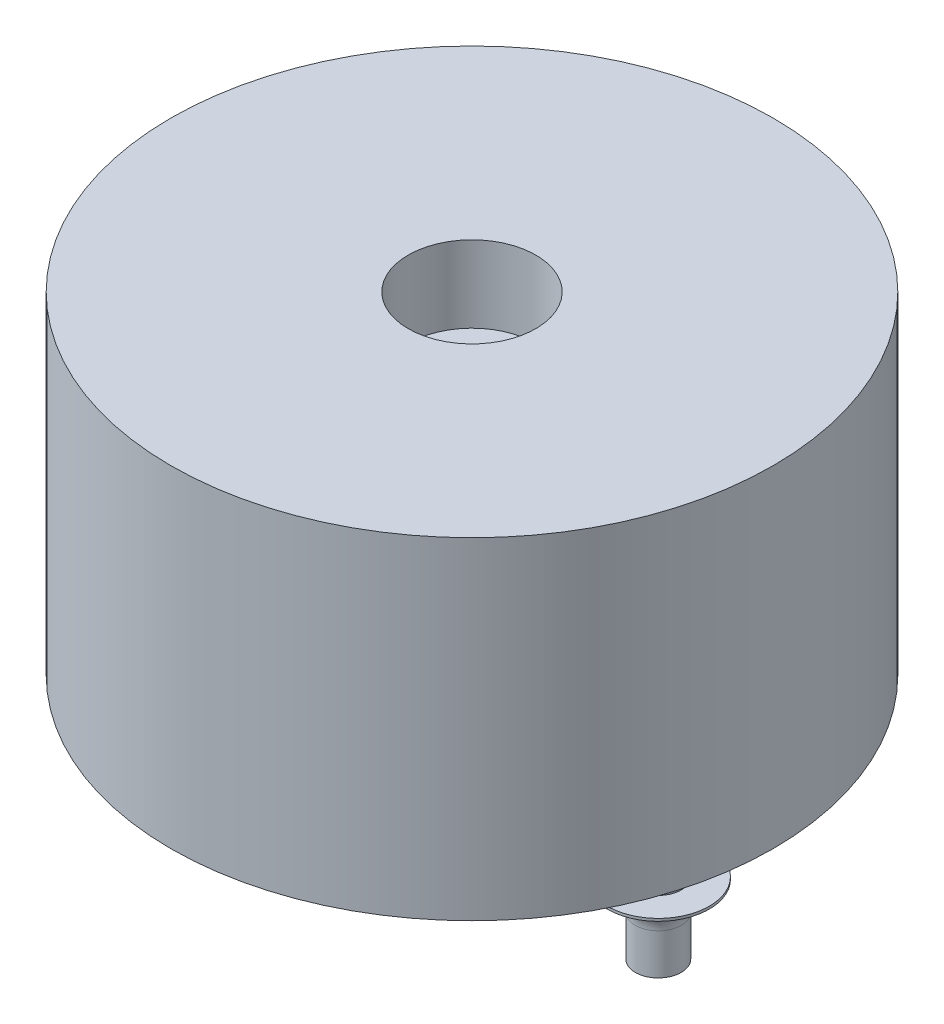
ISO-10303-21;
HEADER;
FILE_DESCRIPTION(('STEP AP214'),'2;1');
FILE_NAME('part.step','',(''),(''),'','','');
FILE_SCHEMA(('AUTOMOTIVE_DESIGN { 1 0 10303 214 1 1 1 1 }'));
ENDSEC;
DATA;
#1=APPLICATION_CONTEXT('core data for automotive mechanical design processes');
#2=APPLICATION_PROTOCOL_DEFINITION('international standard','automotive_design',2000,#1);
#3=PRODUCT_CONTEXT('',#1,'mechanical');
#4=PRODUCT('Part','Part','',(#3));
#5=PRODUCT_RELATED_PRODUCT_CATEGORY('part','',(#4));
#6=PRODUCT_DEFINITION_FORMATION('','',#4);
#7=PRODUCT_DEFINITION_CONTEXT('part definition',#1,'design');
#8=PRODUCT_DEFINITION('design','',#6,#7);
#9=PRODUCT_DEFINITION_SHAPE('','',#8);
#10=(LENGTH_UNIT() NAMED_UNIT(*) SI_UNIT(.MILLI.,.METRE.));
#11=(NAMED_UNIT(*) PLANE_ANGLE_UNIT() SI_UNIT($,.RADIAN.));
#12=(NAMED_UNIT(*) SI_UNIT($,.STERADIAN.) SOLID_ANGLE_UNIT());
#13=UNCERTAINTY_MEASURE_WITH_UNIT(LENGTH_MEASURE(1.E-05),#10,'distance_accuracy_value','');
#14=(GEOMETRIC_REPRESENTATION_CONTEXT(3) GLOBAL_UNCERTAINTY_ASSIGNED_CONTEXT((#13)) GLOBAL_UNIT_ASSIGNED_CONTEXT((#10,
#11,#12)) REPRESENTATION_CONTEXT('',''));
#15=CARTESIAN_POINT('',(0.,0.,0.));
#16=DIRECTION('',(0.,0.,1.));
#17=DIRECTION('',(1.,0.,0.));
#18=AXIS2_PLACEMENT_3D('',#15,#16,#17);
#19=CARTESIAN_POINT('',(0.,6.5,0.));
#20=DIRECTION('',(0.,-1.,0.));
#21=DIRECTION('',(0.,0.,-1.));
#22=AXIS2_PLACEMENT_3D('',#19,#20,#21);
#23=CYLINDRICAL_SURFACE('',#22,5.9);
#24=CARTESIAN_POINT('',(0.,6.5,0.));
#25=DIRECTION('',(0.,1.,0.));
#26=DIRECTION('',(0.,0.,1.));
#27=AXIS2_PLACEMENT_3D('',#24,#25,#26);
#28=CIRCLE('',#27,5.9);
#29=CARTESIAN_POINT('',(0.,6.5,5.9));
#30=VERTEX_POINT('',#29);
#31=EDGE_CURVE('E10',#30,#30,#28,.T.);
#32=ORIENTED_EDGE('',*,*,#31,.F.);
#33=EDGE_LOOP('',(#32));
#34=FACE_BOUND('',#33,.T.);
#35=CARTESIAN_POINT('',(0.,0.,0.));
#36=DIRECTION('',(0.,1.,0.));
#37=DIRECTION('',(0.,0.,1.));
#38=AXIS2_PLACEMENT_3D('',#35,#36,#37);
#39=CIRCLE('',#38,5.9);
#40=CARTESIAN_POINT('',(0.,0.,5.9));
#41=VERTEX_POINT('',#40);
#42=EDGE_CURVE('E35',#41,#41,#39,.T.);
#43=ORIENTED_EDGE('',*,*,#42,.T.);
#44=EDGE_LOOP('',(#43));
#45=FACE_BOUND('',#44,.T.);
#46=ADVANCED_FACE('F32',(#34,#45),#23,.T.);
#47=CARTESIAN_POINT('',(0.,6.5,0.));
#48=DIRECTION('',(0.,1.,0.));
#49=DIRECTION('',(0.,0.,1.));
#50=AXIS2_PLACEMENT_3D('',#47,#48,#49);
#51=PLANE('',#50);
#52=CARTESIAN_POINT('',(0.,6.5,0.));
#53=DIRECTION('',(0.,1.,0.));
#54=DIRECTION('',(0.,0.,1.));
#55=AXIS2_PLACEMENT_3D('',#52,#53,#54);
#56=CIRCLE('',#55,1.25);
#57=CARTESIAN_POINT('',(0.,6.5,1.25));
#58=VERTEX_POINT('',#57);
#59=EDGE_CURVE('E44',#58,#58,#56,.T.);
#60=ORIENTED_EDGE('',*,*,#59,.F.);
#61=EDGE_LOOP('',(#60));
#62=FACE_BOUND('',#61,.T.);
#63=ORIENTED_EDGE('',*,*,#31,.T.);
#64=EDGE_LOOP('',(#63));
#65=FACE_BOUND('',#64,.T.);
#66=ADVANCED_FACE('F98',(#62,#65),#51,.T.);
#67=CARTESIAN_POINT('',(0.,0.,0.));
#68=DIRECTION('',(0.,1.,0.));
#69=DIRECTION('',(0.,0.,1.));
#70=AXIS2_PLACEMENT_3D('',#67,#68,#69);
#71=PLANE('',#70);
#72=CARTESIAN_POINT('',(3.65,0.,0.));
#73=DIRECTION('',(0.,1.,0.));
#74=DIRECTION('',(-1.,0.,0.));
#75=AXIS2_PLACEMENT_3D('',#72,#73,#74);
#76=CIRCLE('',#75,0.449999999999999);
#77=CARTESIAN_POINT('',(3.2,0.,0.));
#78=VERTEX_POINT('',#77);
#79=EDGE_CURVE('E67',#78,#78,#76,.T.);
#80=ORIENTED_EDGE('',*,*,#79,.T.);
#81=EDGE_LOOP('',(#80));
#82=FACE_BOUND('',#81,.T.);
#83=CARTESIAN_POINT('',(-3.65,0.,0.));
#84=DIRECTION('',(0.,1.,0.));
#85=DIRECTION('',(-1.,0.,0.));
#86=AXIS2_PLACEMENT_3D('',#83,#84,#85);
#87=CIRCLE('',#86,0.449999999999999);
#88=CARTESIAN_POINT('',(-4.1,0.,0.));
#89=VERTEX_POINT('',#88);
#90=EDGE_CURVE('E47',#89,#89,#87,.T.);
#91=ORIENTED_EDGE('',*,*,#90,.T.);
#92=EDGE_LOOP('',(#91));
#93=FACE_BOUND('',#92,.T.);
#94=ORIENTED_EDGE('',*,*,#42,.F.);
#95=EDGE_LOOP('',(#94));
#96=FACE_BOUND('',#95,.T.);
#97=ADVANCED_FACE('F103',(#82,#93,#96),#71,.F.);
#98=CARTESIAN_POINT('',(0.,5.,0.));
#99=DIRECTION('',(0.,1.,0.));
#100=DIRECTION('',(0.,0.,1.));
#101=AXIS2_PLACEMENT_3D('',#98,#99,#100);
#102=CYLINDRICAL_SURFACE('',#101,1.25);
#103=CARTESIAN_POINT('',(0.,5.,0.));
#104=DIRECTION('',(0.,1.,0.));
#105=DIRECTION('',(0.,0.,1.));
#106=AXIS2_PLACEMENT_3D('',#103,#104,#105);
#107=CIRCLE('',#106,1.25);
#108=CARTESIAN_POINT('',(0.,5.,1.25));
#109=VERTEX_POINT('',#108);
#110=EDGE_CURVE('E42',#109,#109,#107,.T.);
#111=ORIENTED_EDGE('',*,*,#110,.F.);
#112=EDGE_LOOP('',(#111));
#113=FACE_BOUND('',#112,.T.);
#114=ORIENTED_EDGE('',*,*,#59,.T.);
#115=EDGE_LOOP('',(#114));
#116=FACE_BOUND('',#115,.T.);
#117=ADVANCED_FACE('F110',(#113,#116),#102,.F.);
#118=CARTESIAN_POINT('',(0.,5.,0.));
#119=DIRECTION('',(0.,1.,0.));
#120=DIRECTION('',(0.,0.,1.));
#121=AXIS2_PLACEMENT_3D('',#118,#119,#120);
#122=PLANE('',#121);
#123=ORIENTED_EDGE('',*,*,#110,.T.);
#124=EDGE_LOOP('',(#123));
#125=FACE_BOUND('',#124,.T.);
#126=ADVANCED_FACE('F115',(#125),#122,.T.);
#127=CARTESIAN_POINT('',(-3.65,0.,0.));
#128=DIRECTION('',(0.,1.,0.));
#129=DIRECTION('',(-1.,0.,0.));
#130=AXIS2_PLACEMENT_3D('',#127,#128,#129);
#131=CYLINDRICAL_SURFACE('',#130,0.45);
#132=CARTESIAN_POINT('',(-3.65,-1.6,0.));
#133=DIRECTION('',(0.,1.,0.));
#134=DIRECTION('',(-1.,0.,0.));
#135=AXIS2_PLACEMENT_3D('',#132,#133,#134);
#136=CIRCLE('',#135,0.45);
#137=CARTESIAN_POINT('',(-4.1,-1.6,0.));
#138=VERTEX_POINT('',#137);
#139=EDGE_CURVE('E52',#138,#138,#136,.T.);
#140=ORIENTED_EDGE('',*,*,#139,.T.);
#141=EDGE_LOOP('',(#140));
#142=FACE_BOUND('',#141,.T.);
#143=ORIENTED_EDGE('',*,*,#90,.F.);
#144=EDGE_LOOP('',(#143));
#145=FACE_BOUND('',#144,.T.);
#146=ADVANCED_FACE('F122',(#142,#145),#131,.T.);
#147=CARTESIAN_POINT('',(-4.1,-1.6,0.));
#148=DIRECTION('',(0.,1.,0.));
#149=DIRECTION('',(-1.,0.,0.));
#150=AXIS2_PLACEMENT_3D('',#147,#148,#149);
#151=PLANE('',#150);
#152=CARTESIAN_POINT('',(-3.65,-1.6,0.));
#153=DIRECTION('',(0.,1.,0.));
#154=DIRECTION('',(-1.,0.,0.));
#155=AXIS2_PLACEMENT_3D('',#152,#153,#154);
#156=CIRCLE('',#155,1.);
#157=CARTESIAN_POINT('',(-4.65,-1.6,0.));
#158=VERTEX_POINT('',#157);
#159=EDGE_CURVE('E55',#158,#158,#156,.T.);
#160=ORIENTED_EDGE('',*,*,#159,.T.);
#161=EDGE_LOOP('',(#160));
#162=FACE_BOUND('',#161,.T.);
#163=ORIENTED_EDGE('',*,*,#139,.F.);
#164=EDGE_LOOP('',(#163));
#165=FACE_BOUND('',#164,.T.);
#166=ADVANCED_FACE('F126',(#162,#165),#151,.T.);
#167=CARTESIAN_POINT('',(-3.65,0.,0.));
#168=DIRECTION('',(0.,1.,0.));
#169=DIRECTION('',(-1.,0.,0.));
#170=AXIS2_PLACEMENT_3D('',#167,#168,#169);
#171=CYLINDRICAL_SURFACE('',#170,1.);
#172=CARTESIAN_POINT('',(-3.65,-1.65,0.));
#173=DIRECTION('',(0.,1.,0.));
#174=DIRECTION('',(-1.,0.,0.));
#175=AXIS2_PLACEMENT_3D('',#172,#173,#174);
#176=CIRCLE('',#175,1.);
#177=CARTESIAN_POINT('',(-4.65,-1.65,0.));
#178=VERTEX_POINT('',#177);
#179=EDGE_CURVE('E58',#178,#178,#176,.T.);
#180=ORIENTED_EDGE('',*,*,#179,.T.);
#181=EDGE_LOOP('',(#180));
#182=FACE_BOUND('',#181,.T.);
#183=ORIENTED_EDGE('',*,*,#159,.F.);
#184=EDGE_LOOP('',(#183));
#185=FACE_BOUND('',#184,.T.);
#186=ADVANCED_FACE('F130',(#182,#185),#171,.T.);
#187=CARTESIAN_POINT('',(-3.65,-2.2,0.));
#188=DIRECTION('',(0.,1.,0.));
#189=DIRECTION('',(-1.,0.,0.));
#190=AXIS2_PLACEMENT_3D('',#187,#188,#189);
#191=TOROIDAL_SURFACE('',#190,1.,0.550000000000001);
#192=CARTESIAN_POINT('',(-3.65,-2.2,0.));
#193=DIRECTION('',(0.,1.,0.));
#194=DIRECTION('',(-1.,0.,0.));
#195=AXIS2_PLACEMENT_3D('',#192,#193,#194);
#196=CIRCLE('',#195,0.45);
#197=CARTESIAN_POINT('',(-4.1,-2.2,0.));
#198=VERTEX_POINT('',#197);
#199=EDGE_CURVE('E61',#198,#198,#196,.T.);
#200=ORIENTED_EDGE('',*,*,#199,.T.);
#201=EDGE_LOOP('',(#200));
#202=FACE_BOUND('',#201,.T.);
#203=ORIENTED_EDGE('',*,*,#179,.F.);
#204=EDGE_LOOP('',(#203));
#205=FACE_BOUND('',#204,.T.);
#206=ADVANCED_FACE('F134',(#202,#205),#191,.F.);
#207=CARTESIAN_POINT('',(-3.65,0.,0.));
#208=DIRECTION('',(0.,1.,0.));
#209=DIRECTION('',(-1.,0.,0.));
#210=AXIS2_PLACEMENT_3D('',#207,#208,#209);
#211=CYLINDRICAL_SURFACE('',#210,0.45);
#212=CARTESIAN_POINT('',(-3.65,-3.,0.));
#213=DIRECTION('',(0.,1.,0.));
#214=DIRECTION('',(-1.,0.,0.));
#215=AXIS2_PLACEMENT_3D('',#212,#213,#214);
#216=CIRCLE('',#215,0.45);
#217=CARTESIAN_POINT('',(-4.1,-3.,0.));
#218=VERTEX_POINT('',#217);
#219=EDGE_CURVE('E64',#218,#218,#216,.T.);
#220=ORIENTED_EDGE('',*,*,#219,.T.);
#221=EDGE_LOOP('',(#220));
#222=FACE_BOUND('',#221,.T.);
#223=ORIENTED_EDGE('',*,*,#199,.F.);
#224=EDGE_LOOP('',(#223));
#225=FACE_BOUND('',#224,.T.);
#226=ADVANCED_FACE('F138',(#222,#225),#211,.T.);
#227=CARTESIAN_POINT('',(-3.65,-3.,0.));
#228=DIRECTION('',(0.,-1.,0.));
#229=DIRECTION('',(1.,0.,0.));
#230=AXIS2_PLACEMENT_3D('',#227,#228,#229);
#231=PLANE('',#230);
#232=ORIENTED_EDGE('',*,*,#219,.F.);
#233=EDGE_LOOP('',(#232));
#234=FACE_BOUND('',#233,.T.);
#235=ADVANCED_FACE('F142',(#234),#231,.T.);
#236=CARTESIAN_POINT('',(3.65,0.,0.));
#237=DIRECTION('',(0.,1.,0.));
#238=DIRECTION('',(-1.,0.,0.));
#239=AXIS2_PLACEMENT_3D('',#236,#237,#238);
#240=CYLINDRICAL_SURFACE('',#239,0.45);
#241=CARTESIAN_POINT('',(3.65,-1.6,0.));
#242=DIRECTION('',(0.,1.,0.));
#243=DIRECTION('',(-1.,0.,0.));
#244=AXIS2_PLACEMENT_3D('',#241,#242,#243);
#245=CIRCLE('',#244,0.45);
#246=CARTESIAN_POINT('',(3.2,-1.6,0.));
#247=VERTEX_POINT('',#246);
#248=EDGE_CURVE('E70',#247,#247,#245,.T.);
#249=ORIENTED_EDGE('',*,*,#248,.T.);
#250=EDGE_LOOP('',(#249));
#251=FACE_BOUND('',#250,.T.);
#252=ORIENTED_EDGE('',*,*,#79,.F.);
#253=EDGE_LOOP('',(#252));
#254=FACE_BOUND('',#253,.T.);
#255=ADVANCED_FACE('F146',(#251,#254),#240,.T.);
#256=CARTESIAN_POINT('',(3.2,-1.6,0.));
#257=DIRECTION('',(0.,1.,0.));
#258=DIRECTION('',(-1.,0.,0.));
#259=AXIS2_PLACEMENT_3D('',#256,#257,#258);
#260=PLANE('',#259);
#261=CARTESIAN_POINT('',(3.65,-1.6,0.));
#262=DIRECTION('',(0.,1.,0.));
#263=DIRECTION('',(-1.,0.,0.));
#264=AXIS2_PLACEMENT_3D('',#261,#262,#263);
#265=CIRCLE('',#264,1.);
#266=CARTESIAN_POINT('',(2.65,-1.6,0.));
#267=VERTEX_POINT('',#266);
#268=EDGE_CURVE('E73',#267,#267,#265,.T.);
#269=ORIENTED_EDGE('',*,*,#268,.T.);
#270=EDGE_LOOP('',(#269));
#271=FACE_BOUND('',#270,.T.);
#272=ORIENTED_EDGE('',*,*,#248,.F.);
#273=EDGE_LOOP('',(#272));
#274=FACE_BOUND('',#273,.T.);
#275=ADVANCED_FACE('F150',(#271,#274),#260,.T.);
#276=CARTESIAN_POINT('',(3.65,0.,0.));
#277=DIRECTION('',(0.,1.,0.));
#278=DIRECTION('',(-1.,0.,0.));
#279=AXIS2_PLACEMENT_3D('',#276,#277,#278);
#280=CYLINDRICAL_SURFACE('',#279,1.);
#281=CARTESIAN_POINT('',(3.65,-1.65,0.));
#282=DIRECTION('',(0.,1.,0.));
#283=DIRECTION('',(-1.,0.,0.));
#284=AXIS2_PLACEMENT_3D('',#281,#282,#283);
#285=CIRCLE('',#284,1.);
#286=CARTESIAN_POINT('',(2.65,-1.65,0.));
#287=VERTEX_POINT('',#286);
#288=EDGE_CURVE('E76',#287,#287,#285,.T.);
#289=ORIENTED_EDGE('',*,*,#288,.T.);
#290=EDGE_LOOP('',(#289));
#291=FACE_BOUND('',#290,.T.);
#292=ORIENTED_EDGE('',*,*,#268,.F.);
#293=EDGE_LOOP('',(#292));
#294=FACE_BOUND('',#293,.T.);
#295=ADVANCED_FACE('F154',(#291,#294),#280,.T.);
#296=CARTESIAN_POINT('',(3.65,-2.2,0.));
#297=DIRECTION('',(0.,1.,0.));
#298=DIRECTION('',(-1.,0.,0.));
#299=AXIS2_PLACEMENT_3D('',#296,#297,#298);
#300=TOROIDAL_SURFACE('',#299,1.,0.550000000000001);
#301=CARTESIAN_POINT('',(3.65,-2.2,0.));
#302=DIRECTION('',(0.,1.,0.));
#303=DIRECTION('',(-1.,0.,0.));
#304=AXIS2_PLACEMENT_3D('',#301,#302,#303);
#305=CIRCLE('',#304,0.45);
#306=CARTESIAN_POINT('',(3.2,-2.2,0.));
#307=VERTEX_POINT('',#306);
#308=EDGE_CURVE('E79',#307,#307,#305,.T.);
#309=ORIENTED_EDGE('',*,*,#308,.T.);
#310=EDGE_LOOP('',(#309));
#311=FACE_BOUND('',#310,.T.);
#312=ORIENTED_EDGE('',*,*,#288,.F.);
#313=EDGE_LOOP('',(#312));
#314=FACE_BOUND('',#313,.T.);
#315=ADVANCED_FACE('F95',(#311,#314),#300,.F.);
#316=CARTESIAN_POINT('',(3.65,0.,0.));
#317=DIRECTION('',(0.,1.,0.));
#318=DIRECTION('',(-1.,0.,0.));
#319=AXIS2_PLACEMENT_3D('',#316,#317,#318);
#320=CYLINDRICAL_SURFACE('',#319,0.45);
#321=CARTESIAN_POINT('',(3.65,-3.,0.));
#322=DIRECTION('',(0.,1.,0.));
#323=DIRECTION('',(-1.,0.,0.));
#324=AXIS2_PLACEMENT_3D('',#321,#322,#323);
#325=CIRCLE('',#324,0.45);
#326=CARTESIAN_POINT('',(3.2,-3.,0.));
#327=VERTEX_POINT('',#326);
#328=EDGE_CURVE('E82',#327,#327,#325,.T.);
#329=ORIENTED_EDGE('',*,*,#328,.T.);
#330=EDGE_LOOP('',(#329));
#331=FACE_BOUND('',#330,.T.);
#332=ORIENTED_EDGE('',*,*,#308,.F.);
#333=EDGE_LOOP('',(#332));
#334=FACE_BOUND('',#333,.T.);
#335=ADVANCED_FACE('F86',(#331,#334),#320,.T.);
#336=CARTESIAN_POINT('',(3.65,-3.,0.));
#337=DIRECTION('',(0.,-1.,0.));
#338=DIRECTION('',(1.,0.,0.));
#339=AXIS2_PLACEMENT_3D('',#336,#337,#338);
#340=PLANE('',#339);
#341=ORIENTED_EDGE('',*,*,#328,.F.);
#342=EDGE_LOOP('',(#341));
#343=FACE_BOUND('',#342,.T.);
#344=ADVANCED_FACE('F89',(#343),#340,.T.);
#345=CLOSED_SHELL('',(#46,#66,#97,#117,#126,#146,#166,#186,#206,#226,#235,#255,#275,#295,#315,
#335,#344));
#346=MANIFOLD_SOLID_BREP('B2',#345);
#347=ADVANCED_BREP_SHAPE_REPRESENTATION('',(#18,#346),#14);
#348=SHAPE_DEFINITION_REPRESENTATION(#9,#347);
ENDSEC;
END-ISO-10303-21;
